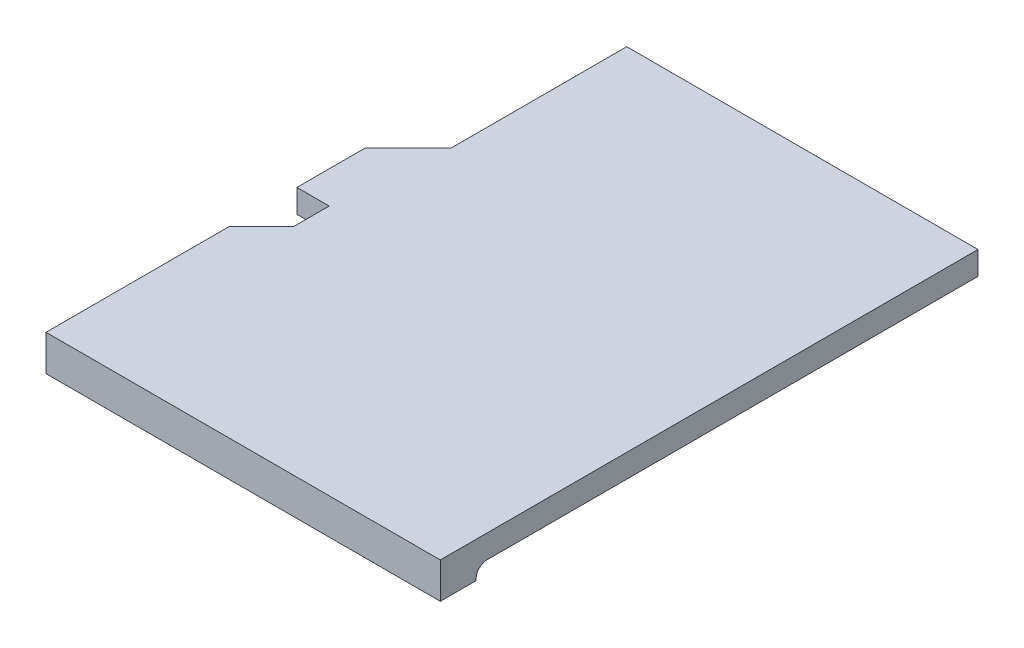
ISO-10303-21;
HEADER;
FILE_DESCRIPTION(('STEP AP214'),'2;1');
FILE_NAME('part.step','',(''),(''),'','','');
FILE_SCHEMA(('AUTOMOTIVE_DESIGN { 1 0 10303 214 1 1 1 1 }'));
ENDSEC;
DATA;
#1=APPLICATION_CONTEXT('core data for automotive mechanical design processes');
#2=APPLICATION_PROTOCOL_DEFINITION('international standard','automotive_design',2000,#1);
#3=PRODUCT_CONTEXT('',#1,'mechanical');
#4=PRODUCT('Part','Part','',(#3));
#5=PRODUCT_RELATED_PRODUCT_CATEGORY('part','',(#4));
#6=PRODUCT_DEFINITION_FORMATION('','',#4);
#7=PRODUCT_DEFINITION_CONTEXT('part definition',#1,'design');
#8=PRODUCT_DEFINITION('design','',#6,#7);
#9=PRODUCT_DEFINITION_SHAPE('','',#8);
#10=(LENGTH_UNIT() NAMED_UNIT(*) SI_UNIT(.MILLI.,.METRE.));
#11=(NAMED_UNIT(*) PLANE_ANGLE_UNIT() SI_UNIT($,.RADIAN.));
#12=(NAMED_UNIT(*) SI_UNIT($,.STERADIAN.) SOLID_ANGLE_UNIT());
#13=UNCERTAINTY_MEASURE_WITH_UNIT(LENGTH_MEASURE(1.E-05),#10,'distance_accuracy_value','');
#14=(GEOMETRIC_REPRESENTATION_CONTEXT(3) GLOBAL_UNCERTAINTY_ASSIGNED_CONTEXT((#13)) GLOBAL_UNIT_ASSIGNED_CONTEXT((#10,
#11,#12)) REPRESENTATION_CONTEXT('',''));
#15=CARTESIAN_POINT('',(0.,0.,0.));
#16=DIRECTION('',(0.,0.,1.));
#17=DIRECTION('',(1.,0.,0.));
#18=AXIS2_PLACEMENT_3D('',#15,#16,#17);
#19=CARTESIAN_POINT('',(0.,0.,36.5));
#20=DIRECTION('',(0.,-1.,0.));
#21=DIRECTION('',(0.,0.,-1.));
#22=AXIS2_PLACEMENT_3D('',#19,#20,#21);
#23=CYLINDRICAL_SURFACE('',#22,30.5);
#24=DIRECTION('',(0.,-1.,0.));
#25=VECTOR('',#24,1.);
#26=CARTESIAN_POINT('',(5.5,0.,6.5));
#27=LINE('',#26,#25);
#28=CARTESIAN_POINT('',(5.5,-0.3,6.5));
#29=VERTEX_POINT('',#28);
#30=CARTESIAN_POINT('',(5.5,-0.35,6.5));
#31=VERTEX_POINT('',#30);
#32=EDGE_CURVE('E119',#29,#31,#27,.T.);
#33=ORIENTED_EDGE('',*,*,#32,.T.);
#34=CARTESIAN_POINT('',(0.,-0.35,36.5));
#35=DIRECTION('',(0.,-1.,0.));
#36=DIRECTION('',(0.,0.,-1.));
#37=AXIS2_PLACEMENT_3D('',#34,#35,#36);
#38=CIRCLE('',#37,30.5);
#39=CARTESIAN_POINT('',(-5.5,-0.35,6.5));
#40=VERTEX_POINT('',#39);
#41=EDGE_CURVE('E139',#40,#31,#38,.T.);
#42=ORIENTED_EDGE('',*,*,#41,.F.);
#43=DIRECTION('',(0.,-1.,0.));
#44=VECTOR('',#43,1.);
#45=CARTESIAN_POINT('',(-5.5,0.,6.5));
#46=LINE('',#45,#44);
#47=CARTESIAN_POINT('',(-5.5,-0.299999999999936,6.5));
#48=VERTEX_POINT('',#47);
#49=EDGE_CURVE('E128',#40,#48,#46,.F.);
#50=ORIENTED_EDGE('',*,*,#49,.T.);
#51=CARTESIAN_POINT('',(0.,-0.300000000000005,36.4999999999999));
#52=DIRECTION('',(0.,1.,0.));
#53=DIRECTION('',(0.,0.,1.));
#54=AXIS2_PLACEMENT_3D('',#51,#52,#53);
#55=CIRCLE('',#54,30.4999999999999);
#56=EDGE_CURVE('E114',#48,#29,#55,.F.);
#57=ORIENTED_EDGE('',*,*,#56,.T.);
#58=EDGE_LOOP('',(#33,#42,#50,#57));
#59=FACE_BOUND('',#58,.T.);
#60=ADVANCED_FACE('F17',(#59),#23,.T.);
#61=CARTESIAN_POINT('',(0.,-0.300000000000007,36.4999999999999));
#62=DIRECTION('',(0.,1.,0.));
#63=DIRECTION('',(0.,0.,1.));
#64=AXIS2_PLACEMENT_3D('',#61,#62,#63);
#65=TOROIDAL_SURFACE('',#64,30.7999999999999,0.300000000000001);
#66=CARTESIAN_POINT('',(0.,0.,36.4999999999999));
#67=DIRECTION('',(0.,-1.,0.));
#68=DIRECTION('',(-0.178571428571428,0.,-0.983926950996851));
#69=AXIS2_PLACEMENT_3D('',#66,#67,#68);
#70=CIRCLE('',#69,30.7999999999999);
#71=CARTESIAN_POINT('',(-5.49999999999999,0.,6.19504990929698));
#72=VERTEX_POINT('',#71);
#73=CARTESIAN_POINT('',(5.5,0.,6.19504990929699));
#74=VERTEX_POINT('',#73);
#75=EDGE_CURVE('E135',#72,#74,#70,.T.);
#76=ORIENTED_EDGE('',*,*,#75,.T.);
#77=CARTESIAN_POINT('',(5.5,-0.3,6.5));
#78=CARTESIAN_POINT('',(5.49999999999996,-0.2833220272923,6.50001549346963));
#79=CARTESIAN_POINT('',(5.49999999999998,-0.266649991355989,6.49858702026892));
#80=CARTESIAN_POINT('',(5.50000000000002,-0.233801123224785,6.49295845943377));
#81=CARTESIAN_POINT('',(5.50000000000004,-0.21762369685712,6.48876184600417));
#82=CARTESIAN_POINT('',(5.49999999999996,-0.186198271619581,6.47771103302167));
#83=CARTESIAN_POINT('',(5.49999999999985,-0.17095057055962,6.47085598704032));
#84=CARTESIAN_POINT('',(5.50000000000015,-0.141812070083495,6.45470279694149));
#85=CARTESIAN_POINT('',(5.50000000000055,-0.127921211183975,6.44540475998965));
#86=CARTESIAN_POINT('',(5.50000000000051,-0.101774813221854,6.42456445317544));
#87=CARTESIAN_POINT('',(5.50000000000006,-0.0895318508629354,6.41300641226746));
#88=CARTESIAN_POINT('',(5.49999999999994,-0.0671233254217907,6.38802611476665));
#89=CARTESIAN_POINT('',(5.50000000000026,-0.0569579996828737,6.37460364548067));
#90=CARTESIAN_POINT('',(5.50000000000031,-0.0388245508854174,6.34605271408475));
#91=CARTESIAN_POINT('',(5.50000000000004,-0.0308934194654272,6.33090078154519));
#92=CARTESIAN_POINT('',(5.49999999999996,-0.0176486358557593,6.2994957466121));
#93=CARTESIAN_POINT('',(5.50000000000014,-0.0123340403630539,6.28324304347134));
#94=CARTESIAN_POINT('',(5.50000000000015,-0.00560463269504171,6.25494252531883));
#95=CARTESIAN_POINT('',(5.50000000000006,-0.00350419527526123,6.24305286728714));
#96=CARTESIAN_POINT('',(5.49999999999994,-0.000701922432729332,6.21912686292336));
#97=CARTESIAN_POINT('',(5.4999999999999,1.8785395189094E-06,6.20709074676156));
#98=CARTESIAN_POINT('',(5.5,0.,6.19504990929699));
#99=B_SPLINE_CURVE_WITH_KNOTS('',3,(#77,#78,#79,#80,#81,#82,#83,#84,#85,#86,#87,#88,#89,#90,#91,
#92,#93,#94,#95,#96,#97,#98),.UNSPECIFIED.,.F.,.F.,(4,2,2,2,2,2,2,2,2,2,4),(0.,
0.0499640333725193,0.0998654774881921,0.14978282297627,0.199697979127058,0.249974761885353,
0.300257284914318,0.351329041840029,0.402382373073721,0.438526066866835,0.474618857831889),.UNSPECIFIED.);
#100=EDGE_CURVE('E122',#29,#74,#99,.T.);
#101=ORIENTED_EDGE('',*,*,#100,.F.);
#102=ORIENTED_EDGE('',*,*,#56,.F.);
#103=CARTESIAN_POINT('',(-5.5,0.,6.19504990929698));
#104=CARTESIAN_POINT('',(-5.49999999999951,1.3359166367053E-05,6.21241243459702));
#105=CARTESIAN_POINT('',(-5.49999999999971,-0.00145847492078227,6.22977221391286));
#106=CARTESIAN_POINT('',(-5.50000000000029,-0.00727537093845298,6.26399834473381));
#107=CARTESIAN_POINT('',(-5.50000000000067,-0.0116195360169983,6.28086484854244));
#108=CARTESIAN_POINT('',(-5.50000000000037,-0.0230876845066247,6.31363832614259));
#109=CARTESIAN_POINT('',(-5.49999999999971,-0.0302134299476659,6.32954468432762));
#110=CARTESIAN_POINT('',(-5.50000000000029,-0.0470507940960684,6.35991909393008));
#111=CARTESIAN_POINT('',(-5.50000000000155,-0.0567616194024485,6.37438758478329));
#112=CARTESIAN_POINT('',(-5.50000000000161,-0.0784294057998133,6.4013604093999));
#113=CARTESIAN_POINT('',(-5.50000000000043,-0.0903696361954466,6.41387817559001));
#114=CARTESIAN_POINT('',(-5.49999999999957,-0.116211132024589,6.43669167210007));
#115=CARTESIAN_POINT('',(-5.49999999999989,-0.130112084961422,6.4469877558478));
#116=CARTESIAN_POINT('',(-5.50000000000012,-0.159253136893745,6.46489826908499));
#117=CARTESIAN_POINT('',(-5.50000000000003,-0.174469702927339,6.47255103554552));
#118=CARTESIAN_POINT('',(-5.49999999999997,-0.205980556919419,6.48514460204624));
#119=CARTESIAN_POINT('',(-5.5,-0.222273944317636,6.49008763690061));
#120=CARTESIAN_POINT('',(-5.50000000000001,-0.248909603235749,6.49572631466867));
#121=CARTESIAN_POINT('',(-5.5,-0.259068674145312,6.49732802223716));
#122=CARTESIAN_POINT('',(-5.5,-0.27948357873713,6.49946458489194));
#123=CARTESIAN_POINT('',(-5.5,-0.289739252276531,6.50000097072089));
#124=CARTESIAN_POINT('',(-5.5,-0.299999999999933,6.5));
#125=B_SPLINE_CURVE_WITH_KNOTS('',3,(#103,#104,#105,#106,#107,#108,#109,#110,#111,#112,#113,
#114,#115,#116,#117,#118,#119,#120,#121,#122,#123,#124),.UNSPECIFIED.,.F.,.F.,(4,2,2,2,2,2,2,2,
2,2,4),(0.,0.0520216922137013,0.104027148924237,0.156065602799876,0.208088103646515,
0.259734841042157,0.31137335634877,0.362227955165807,0.413040549003683,0.443843165959391,
0.474601491046888),.UNSPECIFIED.);
#126=EDGE_CURVE('E138',#72,#48,#125,.T.);
#127=ORIENTED_EDGE('',*,*,#126,.F.);
#128=EDGE_LOOP('',(#76,#101,#102,#127));
#129=FACE_BOUND('',#128,.T.);
#130=ADVANCED_FACE('F133',(#129),#65,.F.);
#131=CARTESIAN_POINT('',(0.,-0.35,6.93372741582503));
#132=DIRECTION('',(0.,-1.,0.));
#133=DIRECTION('',(0.,0.,-1.));
#134=AXIS2_PLACEMENT_3D('',#131,#132,#133);
#135=PLANE('',#134);
#136=DIRECTION('',(0.,0.,-1.));
#137=VECTOR('',#136,1.);
#138=CARTESIAN_POINT('',(5.5,-0.35,6.93372741582503));
#139=LINE('',#138,#137);
#140=CARTESIAN_POINT('',(5.5,-0.35,7.5));
#141=VERTEX_POINT('',#140);
#142=EDGE_CURVE('E125',#31,#141,#139,.F.);
#143=ORIENTED_EDGE('',*,*,#142,.T.);
#144=DIRECTION('',(1.,0.,0.));
#145=VECTOR('',#144,1.);
#146=CARTESIAN_POINT('',(-5.5,-0.35,7.5));
#147=LINE('',#146,#145);
#148=CARTESIAN_POINT('',(-5.5,-0.35,7.5));
#149=VERTEX_POINT('',#148);
#150=EDGE_CURVE('E229',#149,#141,#147,.T.);
#151=ORIENTED_EDGE('',*,*,#150,.F.);
#152=DIRECTION('',(0.,0.,1.));
#153=VECTOR('',#152,1.);
#154=CARTESIAN_POINT('',(-5.5,-0.35,2.4));
#155=LINE('',#154,#153);
#156=EDGE_CURVE('E205',#40,#149,#155,.T.);
#157=ORIENTED_EDGE('',*,*,#156,.F.);
#158=ORIENTED_EDGE('',*,*,#41,.T.);
#159=EDGE_LOOP('',(#143,#151,#157,#158));
#160=FACE_BOUND('',#159,.T.);
#161=ADVANCED_FACE('F173',(#160),#135,.T.);
#162=CARTESIAN_POINT('',(0.0936244587815548,0.,0.17467868973583));
#163=DIRECTION('',(0.,1.,0.));
#164=DIRECTION('',(0.,0.,1.));
#165=AXIS2_PLACEMENT_3D('',#162,#163,#164);
#166=PLANE('',#165);
#167=DIRECTION('',(0.,0.,1.));
#168=VECTOR('',#167,1.);
#169=CARTESIAN_POINT('',(-4.6,0.,0.5));
#170=LINE('',#169,#168);
#171=CARTESIAN_POINT('',(-4.6,0.,0.5));
#172=VERTEX_POINT('',#171);
#173=CARTESIAN_POINT('',(-4.6,0.,1.5));
#174=VERTEX_POINT('',#173);
#175=EDGE_CURVE('E240',#172,#174,#170,.T.);
#176=ORIENTED_EDGE('',*,*,#175,.F.);
#177=DIRECTION('',(1.,0.,0.));
#178=VECTOR('',#177,1.);
#179=CARTESIAN_POINT('',(-5.5,0.,0.5));
#180=LINE('',#179,#178);
#181=CARTESIAN_POINT('',(-5.5,0.,0.5));
#182=VERTEX_POINT('',#181);
#183=EDGE_CURVE('E243',#182,#172,#180,.T.);
#184=ORIENTED_EDGE('',*,*,#183,.F.);
#185=DIRECTION('',(0.,0.,1.));
#186=VECTOR('',#185,1.);
#187=CARTESIAN_POINT('',(-5.5,0.,-1.4));
#188=LINE('',#187,#186);
#189=CARTESIAN_POINT('',(-5.5,0.,-1.4));
#190=VERTEX_POINT('',#189);
#191=EDGE_CURVE('E261',#190,#182,#188,.T.);
#192=ORIENTED_EDGE('',*,*,#191,.F.);
#193=DIRECTION('',(-0.707106781186548,0.,0.707106781186547));
#194=VECTOR('',#193,1.);
#195=CARTESIAN_POINT('',(-4.3,0.,-2.6));
#196=LINE('',#195,#194);
#197=CARTESIAN_POINT('',(-4.3,0.,-2.6));
#198=VERTEX_POINT('',#197);
#199=EDGE_CURVE('E299',#198,#190,#196,.T.);
#200=ORIENTED_EDGE('',*,*,#199,.F.);
#201=DIRECTION('',(0.,0.,1.));
#202=VECTOR('',#201,1.);
#203=CARTESIAN_POINT('',(-4.3,0.,-7.5));
#204=LINE('',#203,#202);
#205=CARTESIAN_POINT('',(-4.3,0.,-7.5));
#206=VERTEX_POINT('',#205);
#207=EDGE_CURVE('E195',#206,#198,#204,.T.);
#208=ORIENTED_EDGE('',*,*,#207,.F.);
#209=DIRECTION('',(-1.,0.,0.));
#210=VECTOR('',#209,1.);
#211=CARTESIAN_POINT('',(5.5,0.,-7.5));
#212=LINE('',#211,#210);
#213=CARTESIAN_POINT('',(5.5,0.,-7.5));
#214=VERTEX_POINT('',#213);
#215=EDGE_CURVE('E181',#214,#206,#212,.T.);
#216=ORIENTED_EDGE('',*,*,#215,.F.);
#217=DIRECTION('',(0.,0.,-1.));
#218=VECTOR('',#217,1.);
#219=CARTESIAN_POINT('',(5.5,0.,7.5));
#220=LINE('',#219,#218);
#221=EDGE_CURVE('E190',#74,#214,#220,.T.);
#222=ORIENTED_EDGE('',*,*,#221,.F.);
#223=ORIENTED_EDGE('',*,*,#75,.F.);
#224=DIRECTION('',(0.,0.,1.));
#225=VECTOR('',#224,1.);
#226=CARTESIAN_POINT('',(-5.5,0.,2.4));
#227=LINE('',#226,#225);
#228=CARTESIAN_POINT('',(-5.5,0.,2.4));
#229=VERTEX_POINT('',#228);
#230=EDGE_CURVE('E204',#229,#72,#227,.T.);
#231=ORIENTED_EDGE('',*,*,#230,.F.);
#232=DIRECTION('',(-0.707106781186547,0.,0.707106781186548));
#233=VECTOR('',#232,1.);
#234=CARTESIAN_POINT('',(-4.6,0.,1.5));
#235=LINE('',#234,#233);
#236=EDGE_CURVE('E208',#174,#229,#235,.T.);
#237=ORIENTED_EDGE('',*,*,#236,.F.);
#238=EDGE_LOOP('',(#176,#184,#192,#200,#208,#216,#222,#223,#231,#237));
#239=FACE_BOUND('',#238,.T.);
#240=ADVANCED_FACE('F169',(#239),#166,.F.);
#241=CARTESIAN_POINT('',(-5.5,0.,0.5));
#242=DIRECTION('',(0.,0.,1.));
#243=DIRECTION('',(1.,0.,0.));
#244=AXIS2_PLACEMENT_3D('',#241,#242,#243);
#245=PLANE('',#244);
#246=DIRECTION('',(1.,0.,0.));
#247=VECTOR('',#246,1.);
#248=CARTESIAN_POINT('',(0.0936244587815549,0.65,0.5));
#249=LINE('',#248,#247);
#250=CARTESIAN_POINT('',(-5.5,0.65,0.5));
#251=VERTEX_POINT('',#250);
#252=CARTESIAN_POINT('',(-4.6,0.65,0.5));
#253=VERTEX_POINT('',#252);
#254=EDGE_CURVE('E304',#251,#253,#249,.T.);
#255=ORIENTED_EDGE('',*,*,#254,.F.);
#256=DIRECTION('',(0.,1.,0.));
#257=VECTOR('',#256,1.);
#258=CARTESIAN_POINT('',(-5.5,0.,0.5));
#259=LINE('',#258,#257);
#260=EDGE_CURVE('E258',#182,#251,#259,.T.);
#261=ORIENTED_EDGE('',*,*,#260,.F.);
#262=ORIENTED_EDGE('',*,*,#183,.T.);
#263=DIRECTION('',(0.,1.,0.));
#264=VECTOR('',#263,1.);
#265=CARTESIAN_POINT('',(-4.6,0.,0.5));
#266=LINE('',#265,#264);
#267=EDGE_CURVE('E211',#253,#172,#266,.F.);
#268=ORIENTED_EDGE('',*,*,#267,.F.);
#269=EDGE_LOOP('',(#255,#261,#262,#268));
#270=FACE_BOUND('',#269,.T.);
#271=ADVANCED_FACE('F165',(#270),#245,.T.);
#272=CARTESIAN_POINT('',(-4.6,0.,0.5));
#273=DIRECTION('',(-1.,0.,0.));
#274=DIRECTION('',(0.,0.,1.));
#275=AXIS2_PLACEMENT_3D('',#272,#273,#274);
#276=PLANE('',#275);
#277=DIRECTION('',(0.,0.,1.));
#278=VECTOR('',#277,1.);
#279=CARTESIAN_POINT('',(-4.6,0.65,0.17467868973583));
#280=LINE('',#279,#278);
#281=CARTESIAN_POINT('',(-4.6,0.65,1.5));
#282=VERTEX_POINT('',#281);
#283=EDGE_CURVE('E223',#253,#282,#280,.T.);
#284=ORIENTED_EDGE('',*,*,#283,.F.);
#285=ORIENTED_EDGE('',*,*,#267,.T.);
#286=ORIENTED_EDGE('',*,*,#175,.T.);
#287=DIRECTION('',(0.,1.,0.));
#288=VECTOR('',#287,1.);
#289=CARTESIAN_POINT('',(-4.6,0.,1.5));
#290=LINE('',#289,#288);
#291=EDGE_CURVE('E210',#282,#174,#290,.F.);
#292=ORIENTED_EDGE('',*,*,#291,.F.);
#293=EDGE_LOOP('',(#284,#285,#286,#292));
#294=FACE_BOUND('',#293,.T.);
#295=ADVANCED_FACE('F161',(#294),#276,.T.);
#296=CARTESIAN_POINT('',(-4.6,0.,1.5));
#297=DIRECTION('',(-0.707106781186548,0.,-0.707106781186547));
#298=DIRECTION('',(-0.707106781186547,0.,0.707106781186548));
#299=AXIS2_PLACEMENT_3D('',#296,#297,#298);
#300=PLANE('',#299);
#301=DIRECTION('',(-0.707106781186548,0.,0.707106781186548));
#302=VECTOR('',#301,1.);
#303=CARTESIAN_POINT('',(-4.6,0.65,1.5));
#304=LINE('',#303,#302);
#305=CARTESIAN_POINT('',(-5.5,0.65,2.4));
#306=VERTEX_POINT('',#305);
#307=EDGE_CURVE('E218',#282,#306,#304,.T.);
#308=ORIENTED_EDGE('',*,*,#307,.F.);
#309=ORIENTED_EDGE('',*,*,#291,.T.);
#310=ORIENTED_EDGE('',*,*,#236,.T.);
#311=DIRECTION('',(0.,1.,0.));
#312=VECTOR('',#311,1.);
#313=CARTESIAN_POINT('',(-5.5,0.,2.4));
#314=LINE('',#313,#312);
#315=EDGE_CURVE('E201',#306,#229,#314,.F.);
#316=ORIENTED_EDGE('',*,*,#315,.F.);
#317=EDGE_LOOP('',(#308,#309,#310,#316));
#318=FACE_BOUND('',#317,.T.);
#319=ADVANCED_FACE('F157',(#318),#300,.T.);
#320=CARTESIAN_POINT('',(-5.5,0.,2.4));
#321=DIRECTION('',(-1.,0.,0.));
#322=DIRECTION('',(0.,0.,1.));
#323=AXIS2_PLACEMENT_3D('',#320,#321,#322);
#324=PLANE('',#323);
#325=ORIENTED_EDGE('',*,*,#126,.T.);
#326=ORIENTED_EDGE('',*,*,#49,.F.);
#327=ORIENTED_EDGE('',*,*,#156,.T.);
#328=DIRECTION('',(0.,1.,0.));
#329=VECTOR('',#328,1.);
#330=CARTESIAN_POINT('',(-5.5,0.,7.5));
#331=LINE('',#330,#329);
#332=CARTESIAN_POINT('',(-5.5,0.65,7.5));
#333=VERTEX_POINT('',#332);
#334=EDGE_CURVE('E233',#333,#149,#331,.F.);
#335=ORIENTED_EDGE('',*,*,#334,.F.);
#336=DIRECTION('',(0.,0.,1.));
#337=VECTOR('',#336,1.);
#338=CARTESIAN_POINT('',(-5.5,0.65,0.17467868973583));
#339=LINE('',#338,#337);
#340=EDGE_CURVE('E214',#306,#333,#339,.T.);
#341=ORIENTED_EDGE('',*,*,#340,.F.);
#342=ORIENTED_EDGE('',*,*,#315,.T.);
#343=ORIENTED_EDGE('',*,*,#230,.T.);
#344=EDGE_LOOP('',(#325,#326,#327,#335,#341,#342,#343));
#345=FACE_BOUND('',#344,.T.);
#346=ADVANCED_FACE('F151',(#345),#324,.T.);
#347=CARTESIAN_POINT('',(-5.5,0.,7.5));
#348=DIRECTION('',(0.,0.,1.));
#349=DIRECTION('',(1.,0.,0.));
#350=AXIS2_PLACEMENT_3D('',#347,#348,#349);
#351=PLANE('',#350);
#352=ORIENTED_EDGE('',*,*,#334,.T.);
#353=ORIENTED_EDGE('',*,*,#150,.T.);
#354=DIRECTION('',(0.,1.,0.));
#355=VECTOR('',#354,1.);
#356=CARTESIAN_POINT('',(5.5,0.,7.5));
#357=LINE('',#356,#355);
#358=CARTESIAN_POINT('',(5.5,0.65,7.5));
#359=VERTEX_POINT('',#358);
#360=EDGE_CURVE('E232',#359,#141,#357,.F.);
#361=ORIENTED_EDGE('',*,*,#360,.F.);
#362=DIRECTION('',(1.,0.,0.));
#363=VECTOR('',#362,1.);
#364=CARTESIAN_POINT('',(0.0936244587815549,0.65,7.5));
#365=LINE('',#364,#363);
#366=EDGE_CURVE('E217',#333,#359,#365,.T.);
#367=ORIENTED_EDGE('',*,*,#366,.F.);
#368=EDGE_LOOP('',(#352,#353,#361,#367));
#369=FACE_BOUND('',#368,.T.);
#370=ADVANCED_FACE('F156',(#369),#351,.T.);
#371=CARTESIAN_POINT('',(5.5,0.,7.5));
#372=DIRECTION('',(1.,0.,0.));
#373=DIRECTION('',(0.,0.,-1.));
#374=AXIS2_PLACEMENT_3D('',#371,#372,#373);
#375=PLANE('',#374);
#376=DIRECTION('',(0.,1.,0.));
#377=VECTOR('',#376,1.);
#378=CARTESIAN_POINT('',(5.5,0.,-7.5));
#379=LINE('',#378,#377);
#380=CARTESIAN_POINT('',(5.5,0.65,-7.5));
#381=VERTEX_POINT('',#380);
#382=EDGE_CURVE('E189',#381,#214,#379,.F.);
#383=ORIENTED_EDGE('',*,*,#382,.F.);
#384=DIRECTION('',(0.,0.,1.));
#385=VECTOR('',#384,1.);
#386=CARTESIAN_POINT('',(5.5,0.65,0.17467868973583));
#387=LINE('',#386,#385);
#388=EDGE_CURVE('E311',#359,#381,#387,.F.);
#389=ORIENTED_EDGE('',*,*,#388,.F.);
#390=ORIENTED_EDGE('',*,*,#360,.T.);
#391=ORIENTED_EDGE('',*,*,#142,.F.);
#392=ORIENTED_EDGE('',*,*,#32,.F.);
#393=ORIENTED_EDGE('',*,*,#100,.T.);
#394=ORIENTED_EDGE('',*,*,#221,.T.);
#395=EDGE_LOOP('',(#383,#389,#390,#391,#392,#393,#394));
#396=FACE_BOUND('',#395,.T.);
#397=ADVANCED_FACE('F120',(#396),#375,.T.);
#398=CARTESIAN_POINT('',(5.5,0.,-7.5));
#399=DIRECTION('',(0.,0.,-1.));
#400=DIRECTION('',(-1.,0.,0.));
#401=AXIS2_PLACEMENT_3D('',#398,#399,#400);
#402=PLANE('',#401);
#403=DIRECTION('',(1.,0.,0.));
#404=VECTOR('',#403,1.);
#405=CARTESIAN_POINT('',(0.0936244587815549,0.65,-7.5));
#406=LINE('',#405,#404);
#407=CARTESIAN_POINT('',(-4.3,0.65,-7.5));
#408=VERTEX_POINT('',#407);
#409=EDGE_CURVE('E314',#381,#408,#406,.F.);
#410=ORIENTED_EDGE('',*,*,#409,.F.);
#411=ORIENTED_EDGE('',*,*,#382,.T.);
#412=ORIENTED_EDGE('',*,*,#215,.T.);
#413=DIRECTION('',(0.,1.,0.));
#414=VECTOR('',#413,1.);
#415=CARTESIAN_POINT('',(-4.3,0.,-7.5));
#416=LINE('',#415,#414);
#417=EDGE_CURVE('E296',#408,#206,#416,.F.);
#418=ORIENTED_EDGE('',*,*,#417,.F.);
#419=EDGE_LOOP('',(#410,#411,#412,#418));
#420=FACE_BOUND('',#419,.T.);
#421=ADVANCED_FACE('F329',(#420),#402,.T.);
#422=CARTESIAN_POINT('',(-4.3,0.,-7.5));
#423=DIRECTION('',(-1.,0.,0.));
#424=DIRECTION('',(0.,0.,1.));
#425=AXIS2_PLACEMENT_3D('',#422,#423,#424);
#426=PLANE('',#425);
#427=DIRECTION('',(0.,0.,1.));
#428=VECTOR('',#427,1.);
#429=CARTESIAN_POINT('',(-4.3,0.65,0.17467868973583));
#430=LINE('',#429,#428);
#431=CARTESIAN_POINT('',(-4.3,0.65,-2.6));
#432=VERTEX_POINT('',#431);
#433=EDGE_CURVE('E317',#408,#432,#430,.T.);
#434=ORIENTED_EDGE('',*,*,#433,.F.);
#435=ORIENTED_EDGE('',*,*,#417,.T.);
#436=ORIENTED_EDGE('',*,*,#207,.T.);
#437=DIRECTION('',(0.,1.,0.));
#438=VECTOR('',#437,1.);
#439=CARTESIAN_POINT('',(-4.3,0.,-2.6));
#440=LINE('',#439,#438);
#441=EDGE_CURVE('E266',#432,#198,#440,.F.);
#442=ORIENTED_EDGE('',*,*,#441,.F.);
#443=EDGE_LOOP('',(#434,#435,#436,#442));
#444=FACE_BOUND('',#443,.T.);
#445=ADVANCED_FACE('F326',(#444),#426,.T.);
#446=CARTESIAN_POINT('',(-4.3,0.,-2.6));
#447=DIRECTION('',(-0.707106781186547,0.,-0.707106781186548));
#448=DIRECTION('',(-0.707106781186548,0.,0.707106781186547));
#449=AXIS2_PLACEMENT_3D('',#446,#447,#448);
#450=PLANE('',#449);
#451=DIRECTION('',(-0.707106781186548,0.,0.707106781186547));
#452=VECTOR('',#451,1.);
#453=CARTESIAN_POINT('',(-4.3,0.65,-2.6));
#454=LINE('',#453,#452);
#455=CARTESIAN_POINT('',(-5.5,0.65,-1.4));
#456=VERTEX_POINT('',#455);
#457=EDGE_CURVE('E30',#432,#456,#454,.T.);
#458=ORIENTED_EDGE('',*,*,#457,.F.);
#459=ORIENTED_EDGE('',*,*,#441,.T.);
#460=ORIENTED_EDGE('',*,*,#199,.T.);
#461=DIRECTION('',(0.,1.,0.));
#462=VECTOR('',#461,1.);
#463=CARTESIAN_POINT('',(-5.5,0.,-1.4));
#464=LINE('',#463,#462);
#465=EDGE_CURVE('E39',#456,#190,#464,.F.);
#466=ORIENTED_EDGE('',*,*,#465,.F.);
#467=EDGE_LOOP('',(#458,#459,#460,#466));
#468=FACE_BOUND('',#467,.T.);
#469=ADVANCED_FACE('F324',(#468),#450,.T.);
#470=CARTESIAN_POINT('',(-5.5,0.,-1.4));
#471=DIRECTION('',(-1.,0.,0.));
#472=DIRECTION('',(0.,0.,1.));
#473=AXIS2_PLACEMENT_3D('',#470,#471,#472);
#474=PLANE('',#473);
#475=DIRECTION('',(0.,0.,1.));
#476=VECTOR('',#475,1.);
#477=CARTESIAN_POINT('',(-5.5,0.65,0.17467868973583));
#478=LINE('',#477,#476);
#479=EDGE_CURVE('E11',#456,#251,#478,.T.);
#480=ORIENTED_EDGE('',*,*,#479,.F.);
#481=ORIENTED_EDGE('',*,*,#465,.T.);
#482=ORIENTED_EDGE('',*,*,#191,.T.);
#483=ORIENTED_EDGE('',*,*,#260,.T.);
#484=EDGE_LOOP('',(#480,#481,#482,#483));
#485=FACE_BOUND('',#484,.T.);
#486=ADVANCED_FACE('F338',(#485),#474,.T.);
#487=CARTESIAN_POINT('',(0.0936244587815549,0.65,0.17467868973583));
#488=DIRECTION('',(0.,1.,0.));
#489=DIRECTION('',(0.,0.,1.));
#490=AXIS2_PLACEMENT_3D('',#487,#488,#489);
#491=PLANE('',#490);
#492=ORIENTED_EDGE('',*,*,#457,.T.);
#493=ORIENTED_EDGE('',*,*,#479,.T.);
#494=ORIENTED_EDGE('',*,*,#254,.T.);
#495=ORIENTED_EDGE('',*,*,#283,.T.);
#496=ORIENTED_EDGE('',*,*,#307,.T.);
#497=ORIENTED_EDGE('',*,*,#340,.T.);
#498=ORIENTED_EDGE('',*,*,#366,.T.);
#499=ORIENTED_EDGE('',*,*,#388,.T.);
#500=ORIENTED_EDGE('',*,*,#409,.T.);
#501=ORIENTED_EDGE('',*,*,#433,.T.);
#502=EDGE_LOOP('',(#492,#493,#494,#495,#496,#497,#498,#499,#500,#501));
#503=FACE_BOUND('',#502,.T.);
#504=ADVANCED_FACE('F322',(#503),#491,.T.);
#505=CLOSED_SHELL('',(#60,#130,#161,#240,#271,#295,#319,#346,#370,#397,#421,#445,#469,#486,#504));
#506=MANIFOLD_SOLID_BREP('B1',#505);
#507=ADVANCED_BREP_SHAPE_REPRESENTATION('',(#18,#506),#14);
#508=SHAPE_DEFINITION_REPRESENTATION(#9,#507);
ENDSEC;
END-ISO-10303-21;
